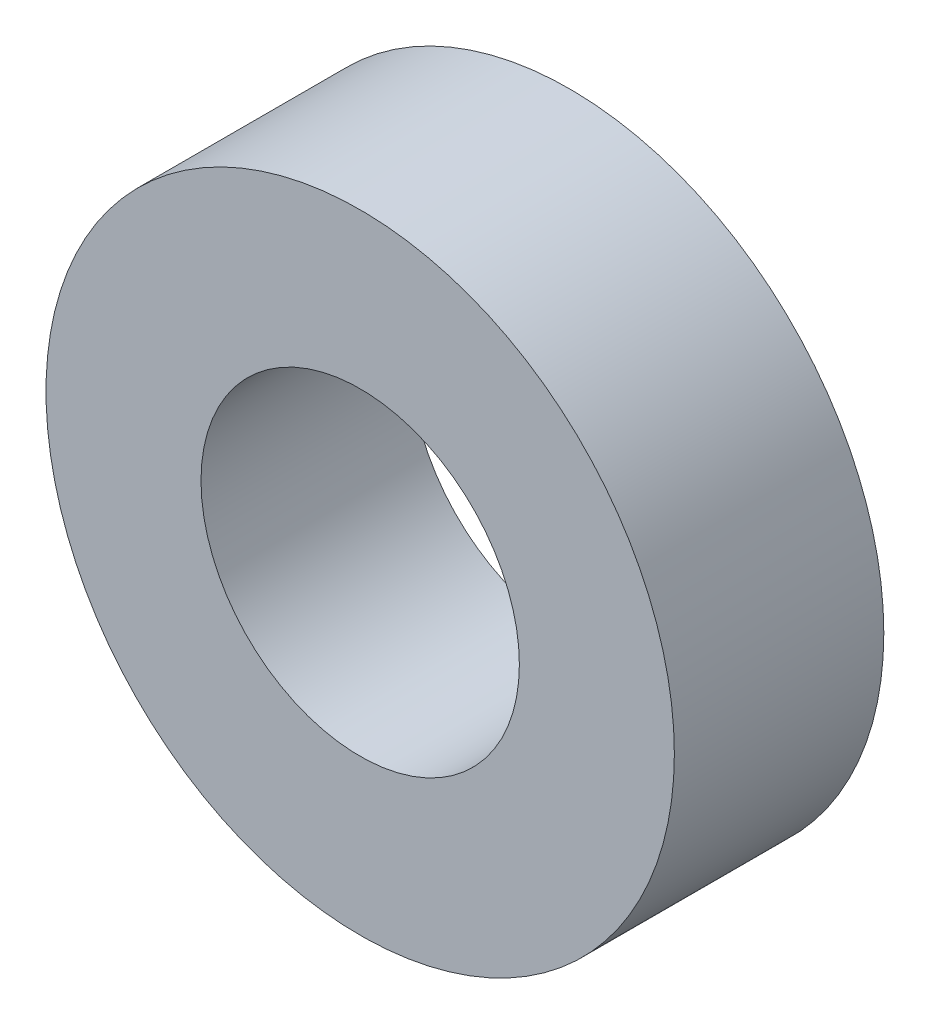
ISO-10303-21;
HEADER;
FILE_DESCRIPTION(('STEP AP214'),'2;1');
FILE_NAME('part.step','',(''),(''),'','','');
FILE_SCHEMA(('AUTOMOTIVE_DESIGN { 1 0 10303 214 1 1 1 1 }'));
ENDSEC;
DATA;
#1=APPLICATION_CONTEXT('core data for automotive mechanical design processes');
#2=APPLICATION_PROTOCOL_DEFINITION('international standard','automotive_design',2000,#1);
#3=PRODUCT_CONTEXT('',#1,'mechanical');
#4=PRODUCT('Part','Part','',(#3));
#5=PRODUCT_RELATED_PRODUCT_CATEGORY('part','',(#4));
#6=PRODUCT_DEFINITION_FORMATION('','',#4);
#7=PRODUCT_DEFINITION_CONTEXT('part definition',#1,'design');
#8=PRODUCT_DEFINITION('design','',#6,#7);
#9=PRODUCT_DEFINITION_SHAPE('','',#8);
#10=(LENGTH_UNIT() NAMED_UNIT(*) SI_UNIT(.MILLI.,.METRE.));
#11=(NAMED_UNIT(*) PLANE_ANGLE_UNIT() SI_UNIT($,.RADIAN.));
#12=(NAMED_UNIT(*) SI_UNIT($,.STERADIAN.) SOLID_ANGLE_UNIT());
#13=UNCERTAINTY_MEASURE_WITH_UNIT(LENGTH_MEASURE(1.E-05),#10,'distance_accuracy_value','');
#14=(GEOMETRIC_REPRESENTATION_CONTEXT(3) GLOBAL_UNCERTAINTY_ASSIGNED_CONTEXT((#13)) GLOBAL_UNIT_ASSIGNED_CONTEXT((#10,
#11,#12)) REPRESENTATION_CONTEXT('',''));
#15=CARTESIAN_POINT('',(0.,0.,0.));
#16=DIRECTION('',(0.,0.,1.));
#17=DIRECTION('',(1.,0.,0.));
#18=AXIS2_PLACEMENT_3D('',#15,#16,#17);
#19=CARTESIAN_POINT('',(0.,0.,3.175));
#20=DIRECTION('',(0.,0.,1.));
#21=DIRECTION('',(1.,0.,0.));
#22=AXIS2_PLACEMENT_3D('',#19,#20,#21);
#23=PLANE('',#22);
#24=CARTESIAN_POINT('',(0.,0.,3.175));
#25=DIRECTION('',(0.,0.,1.));
#26=DIRECTION('',(1.,0.,0.));
#27=AXIS2_PLACEMENT_3D('',#24,#25,#26);
#28=CIRCLE('',#27,9.525);
#29=CARTESIAN_POINT('',(9.525,0.,3.175));
#30=VERTEX_POINT('',#29);
#31=EDGE_CURVE('E10',#30,#30,#28,.T.);
#32=ORIENTED_EDGE('',*,*,#31,.T.);
#33=EDGE_LOOP('',(#32));
#34=FACE_BOUND('',#33,.T.);
#35=CARTESIAN_POINT('',(0.,0.,3.175));
#36=DIRECTION('',(0.,0.,1.));
#37=DIRECTION('',(1.,0.,0.));
#38=AXIS2_PLACEMENT_3D('',#35,#36,#37);
#39=CIRCLE('',#38,4.826);
#40=CARTESIAN_POINT('',(4.826,0.,3.175));
#41=VERTEX_POINT('',#40);
#42=EDGE_CURVE('E44',#41,#41,#39,.T.);
#43=ORIENTED_EDGE('',*,*,#42,.F.);
#44=EDGE_LOOP('',(#43));
#45=FACE_BOUND('',#44,.T.);
#46=ADVANCED_FACE('F33',(#34,#45),#23,.T.);
#47=CARTESIAN_POINT('',(0.,0.,-3.175));
#48=DIRECTION('',(0.,0.,1.));
#49=DIRECTION('',(1.,0.,0.));
#50=AXIS2_PLACEMENT_3D('',#47,#48,#49);
#51=PLANE('',#50);
#52=CARTESIAN_POINT('',(0.,0.,-3.175));
#53=DIRECTION('',(0.,0.,1.));
#54=DIRECTION('',(1.,0.,0.));
#55=AXIS2_PLACEMENT_3D('',#52,#53,#54);
#56=CIRCLE('',#55,9.525);
#57=CARTESIAN_POINT('',(9.525,0.,-3.175));
#58=VERTEX_POINT('',#57);
#59=EDGE_CURVE('E37',#58,#58,#56,.T.);
#60=ORIENTED_EDGE('',*,*,#59,.F.);
#61=EDGE_LOOP('',(#60));
#62=FACE_BOUND('',#61,.T.);
#63=CARTESIAN_POINT('',(0.,0.,-3.175));
#64=DIRECTION('',(0.,0.,1.));
#65=DIRECTION('',(1.,0.,0.));
#66=AXIS2_PLACEMENT_3D('',#63,#64,#65);
#67=CIRCLE('',#66,4.826);
#68=CARTESIAN_POINT('',(4.826,0.,-3.175));
#69=VERTEX_POINT('',#68);
#70=EDGE_CURVE('E46',#69,#69,#67,.T.);
#71=ORIENTED_EDGE('',*,*,#70,.T.);
#72=EDGE_LOOP('',(#71));
#73=FACE_BOUND('',#72,.T.);
#74=ADVANCED_FACE('F56',(#62,#73),#51,.F.);
#75=CARTESIAN_POINT('',(0.,0.,3.175));
#76=DIRECTION('',(0.,0.,-1.));
#77=DIRECTION('',(-1.,0.,0.));
#78=AXIS2_PLACEMENT_3D('',#75,#76,#77);
#79=CYLINDRICAL_SURFACE('',#78,9.525);
#80=ORIENTED_EDGE('',*,*,#31,.F.);
#81=EDGE_LOOP('',(#80));
#82=FACE_BOUND('',#81,.T.);
#83=ORIENTED_EDGE('',*,*,#59,.T.);
#84=EDGE_LOOP('',(#83));
#85=FACE_BOUND('',#84,.T.);
#86=ADVANCED_FACE('F35',(#82,#85),#79,.T.);
#87=CARTESIAN_POINT('',(0.,0.,3.175));
#88=DIRECTION('',(0.,0.,-1.));
#89=DIRECTION('',(-1.,0.,0.));
#90=AXIS2_PLACEMENT_3D('',#87,#88,#89);
#91=CYLINDRICAL_SURFACE('',#90,4.826);
#92=ORIENTED_EDGE('',*,*,#42,.T.);
#93=EDGE_LOOP('',(#92));
#94=FACE_BOUND('',#93,.T.);
#95=ORIENTED_EDGE('',*,*,#70,.F.);
#96=EDGE_LOOP('',(#95));
#97=FACE_BOUND('',#96,.T.);
#98=ADVANCED_FACE('F52',(#94,#97),#91,.F.);
#99=CLOSED_SHELL('',(#46,#74,#86,#98));
#100=MANIFOLD_SOLID_BREP('B2',#99);
#101=ADVANCED_BREP_SHAPE_REPRESENTATION('',(#18,#100),#14);
#102=SHAPE_DEFINITION_REPRESENTATION(#9,#101);
ENDSEC;
END-ISO-10303-21;
